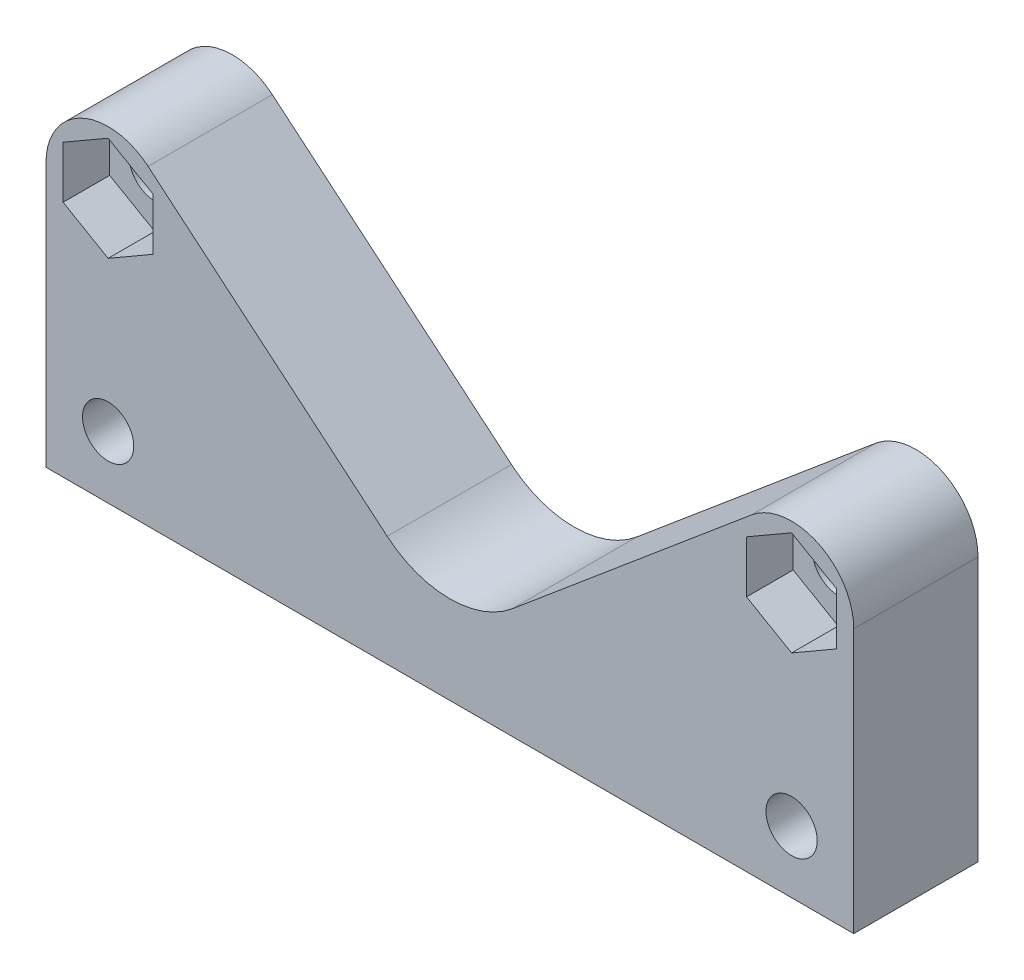
ISO-10303-21;
HEADER;
FILE_DESCRIPTION(('STEP AP214'),'2;1');
FILE_NAME('part.step','',(''),(''),'','','');
FILE_SCHEMA(('AUTOMOTIVE_DESIGN { 1 0 10303 214 1 1 1 1 }'));
ENDSEC;
DATA;
#1=APPLICATION_CONTEXT('core data for automotive mechanical design processes');
#2=APPLICATION_PROTOCOL_DEFINITION('international standard','automotive_design',2000,#1);
#3=PRODUCT_CONTEXT('',#1,'mechanical');
#4=PRODUCT('Part','Part','',(#3));
#5=PRODUCT_RELATED_PRODUCT_CATEGORY('part','',(#4));
#6=PRODUCT_DEFINITION_FORMATION('','',#4);
#7=PRODUCT_DEFINITION_CONTEXT('part definition',#1,'design');
#8=PRODUCT_DEFINITION('design','',#6,#7);
#9=PRODUCT_DEFINITION_SHAPE('','',#8);
#10=(LENGTH_UNIT() NAMED_UNIT(*) SI_UNIT(.MILLI.,.METRE.));
#11=(NAMED_UNIT(*) PLANE_ANGLE_UNIT() SI_UNIT($,.RADIAN.));
#12=(NAMED_UNIT(*) SI_UNIT($,.STERADIAN.) SOLID_ANGLE_UNIT());
#13=UNCERTAINTY_MEASURE_WITH_UNIT(LENGTH_MEASURE(1.E-05),#10,'distance_accuracy_value','');
#14=(GEOMETRIC_REPRESENTATION_CONTEXT(3) GLOBAL_UNCERTAINTY_ASSIGNED_CONTEXT((#13)) GLOBAL_UNIT_ASSIGNED_CONTEXT((#10,
#11,#12)) REPRESENTATION_CONTEXT('',''));
#15=CARTESIAN_POINT('',(0.,0.,0.));
#16=DIRECTION('',(0.,0.,1.));
#17=DIRECTION('',(1.,0.,0.));
#18=AXIS2_PLACEMENT_3D('',#15,#16,#17);
#19=CARTESIAN_POINT('',(48.,17.,8.));
#20=DIRECTION('',(0.,0.,-1.));
#21=DIRECTION('',(-1.,0.,0.));
#22=AXIS2_PLACEMENT_3D('',#19,#20,#21);
#23=CYLINDRICAL_SURFACE('',#22,1.65);
#24=CARTESIAN_POINT('',(48.,17.,0.));
#25=DIRECTION('',(0.,0.,1.));
#26=DIRECTION('',(1.,0.,0.));
#27=AXIS2_PLACEMENT_3D('',#24,#25,#26);
#28=CIRCLE('',#27,1.65);
#29=CARTESIAN_POINT('',(49.65,17.,0.));
#30=VERTEX_POINT('',#29);
#31=EDGE_CURVE('E281',#30,#30,#28,.T.);
#32=ORIENTED_EDGE('',*,*,#31,.F.);
#33=EDGE_LOOP('',(#32));
#34=FACE_BOUND('',#33,.T.);
#35=CARTESIAN_POINT('',(48.,17.,5.));
#36=DIRECTION('',(0.,0.,1.));
#37=DIRECTION('',(1.,0.,0.));
#38=AXIS2_PLACEMENT_3D('',#35,#36,#37);
#39=CIRCLE('',#38,1.65);
#40=CARTESIAN_POINT('',(49.65,17.,5.));
#41=VERTEX_POINT('',#40);
#42=EDGE_CURVE('E35',#41,#41,#39,.T.);
#43=ORIENTED_EDGE('',*,*,#42,.T.);
#44=EDGE_LOOP('',(#43));
#45=FACE_BOUND('',#44,.T.);
#46=ADVANCED_FACE('F31',(#34,#45),#23,.F.);
#47=CARTESIAN_POINT('',(4.,17.,8.));
#48=DIRECTION('',(0.,0.,-1.));
#49=DIRECTION('',(-1.,0.,0.));
#50=AXIS2_PLACEMENT_3D('',#47,#48,#49);
#51=CYLINDRICAL_SURFACE('',#50,1.65);
#52=CARTESIAN_POINT('',(4.,17.,0.));
#53=DIRECTION('',(0.,0.,1.));
#54=DIRECTION('',(1.,0.,0.));
#55=AXIS2_PLACEMENT_3D('',#52,#53,#54);
#56=CIRCLE('',#55,1.65);
#57=CARTESIAN_POINT('',(5.65,17.,0.));
#58=VERTEX_POINT('',#57);
#59=EDGE_CURVE('E286',#58,#58,#56,.T.);
#60=ORIENTED_EDGE('',*,*,#59,.F.);
#61=EDGE_LOOP('',(#60));
#62=FACE_BOUND('',#61,.T.);
#63=CARTESIAN_POINT('',(4.,17.,5.));
#64=DIRECTION('',(0.,0.,1.));
#65=DIRECTION('',(1.,0.,0.));
#66=AXIS2_PLACEMENT_3D('',#63,#64,#65);
#67=CIRCLE('',#66,1.65);
#68=CARTESIAN_POINT('',(5.65,17.,5.));
#69=VERTEX_POINT('',#68);
#70=EDGE_CURVE('E261',#69,#69,#67,.T.);
#71=ORIENTED_EDGE('',*,*,#70,.T.);
#72=EDGE_LOOP('',(#71));
#73=FACE_BOUND('',#72,.T.);
#74=ADVANCED_FACE('F345',(#62,#73),#51,.F.);
#75=CARTESIAN_POINT('',(4.,17.,8.));
#76=DIRECTION('',(0.,0.,1.));
#77=DIRECTION('',(1.,0.,0.));
#78=AXIS2_PLACEMENT_3D('',#75,#76,#77);
#79=PLANE('',#78);
#80=DIRECTION('',(0.866025403784438,-0.5,0.));
#81=VECTOR('',#80,1.);
#82=CARTESIAN_POINT('',(45.1,15.3256842193501,8.));
#83=LINE('',#82,#81);
#84=CARTESIAN_POINT('',(45.1,15.3256842193501,8.));
#85=VERTEX_POINT('',#84);
#86=CARTESIAN_POINT('',(48.,13.6513684387002,8.));
#87=VERTEX_POINT('',#86);
#88=EDGE_CURVE('E48',#85,#87,#83,.T.);
#89=ORIENTED_EDGE('',*,*,#88,.F.);
#90=DIRECTION('',(0.,-1.,0.));
#91=VECTOR('',#90,1.);
#92=CARTESIAN_POINT('',(45.1,18.6743157806499,8.));
#93=LINE('',#92,#91);
#94=CARTESIAN_POINT('',(45.1,18.6743157806499,8.));
#95=VERTEX_POINT('',#94);
#96=EDGE_CURVE('E191',#95,#85,#93,.T.);
#97=ORIENTED_EDGE('',*,*,#96,.F.);
#98=DIRECTION('',(-0.866025403784438,-0.5,0.));
#99=VECTOR('',#98,1.);
#100=CARTESIAN_POINT('',(48.,20.3486315612998,8.));
#101=LINE('',#100,#99);
#102=CARTESIAN_POINT('',(48.,20.3486315612998,8.));
#103=VERTEX_POINT('',#102);
#104=EDGE_CURVE('E194',#103,#95,#101,.T.);
#105=ORIENTED_EDGE('',*,*,#104,.F.);
#106=DIRECTION('',(-0.866025403784438,0.5,0.));
#107=VECTOR('',#106,1.);
#108=CARTESIAN_POINT('',(50.9,18.6743157806499,8.));
#109=LINE('',#108,#107);
#110=CARTESIAN_POINT('',(50.9,18.6743157806499,8.));
#111=VERTEX_POINT('',#110);
#112=EDGE_CURVE('E210',#111,#103,#109,.T.);
#113=ORIENTED_EDGE('',*,*,#112,.F.);
#114=DIRECTION('',(0.,1.,0.));
#115=VECTOR('',#114,1.);
#116=CARTESIAN_POINT('',(50.9,15.3256842193501,8.));
#117=LINE('',#116,#115);
#118=CARTESIAN_POINT('',(50.9,15.3256842193501,8.));
#119=VERTEX_POINT('',#118);
#120=EDGE_CURVE('E207',#119,#111,#117,.T.);
#121=ORIENTED_EDGE('',*,*,#120,.F.);
#122=DIRECTION('',(0.866025403784439,0.5,0.));
#123=VECTOR('',#122,1.);
#124=CARTESIAN_POINT('',(48.,13.6513684387002,8.));
#125=LINE('',#124,#123);
#126=EDGE_CURVE('E205',#87,#119,#125,.T.);
#127=ORIENTED_EDGE('',*,*,#126,.F.);
#128=EDGE_LOOP('',(#89,#97,#105,#113,#121,#127));
#129=FACE_BOUND('',#128,.T.);
#130=DIRECTION('',(0.866025403784439,-0.5,0.));
#131=VECTOR('',#130,1.);
#132=CARTESIAN_POINT('',(1.1,15.3256842193501,8.));
#133=LINE('',#132,#131);
#134=CARTESIAN_POINT('',(1.1,15.3256842193501,8.));
#135=VERTEX_POINT('',#134);
#136=CARTESIAN_POINT('',(4.,13.6513684387002,8.));
#137=VERTEX_POINT('',#136);
#138=EDGE_CURVE('E56',#135,#137,#133,.T.);
#139=ORIENTED_EDGE('',*,*,#138,.F.);
#140=DIRECTION('',(0.,-1.,0.));
#141=VECTOR('',#140,1.);
#142=CARTESIAN_POINT('',(1.1,18.6743157806499,8.));
#143=LINE('',#142,#141);
#144=CARTESIAN_POINT('',(1.1,18.6743157806499,8.));
#145=VERTEX_POINT('',#144);
#146=EDGE_CURVE('E228',#145,#135,#143,.T.);
#147=ORIENTED_EDGE('',*,*,#146,.F.);
#148=DIRECTION('',(-0.866025403784439,-0.5,0.));
#149=VECTOR('',#148,1.);
#150=CARTESIAN_POINT('',(4.,20.3486315612998,8.));
#151=LINE('',#150,#149);
#152=CARTESIAN_POINT('',(4.,20.3486315612998,8.));
#153=VERTEX_POINT('',#152);
#154=EDGE_CURVE('E254',#153,#145,#151,.T.);
#155=ORIENTED_EDGE('',*,*,#154,.F.);
#156=DIRECTION('',(-0.866025403784439,0.5,0.));
#157=VECTOR('',#156,1.);
#158=CARTESIAN_POINT('',(6.9,18.6743157806499,8.));
#159=LINE('',#158,#157);
#160=CARTESIAN_POINT('',(6.9,18.6743157806499,8.));
#161=VERTEX_POINT('',#160);
#162=EDGE_CURVE('E251',#161,#153,#159,.T.);
#163=ORIENTED_EDGE('',*,*,#162,.F.);
#164=DIRECTION('',(0.,1.,0.));
#165=VECTOR('',#164,1.);
#166=CARTESIAN_POINT('',(6.9,15.3256842193501,8.));
#167=LINE('',#166,#165);
#168=CARTESIAN_POINT('',(6.9,15.3256842193501,8.));
#169=VERTEX_POINT('',#168);
#170=EDGE_CURVE('E248',#169,#161,#167,.T.);
#171=ORIENTED_EDGE('',*,*,#170,.F.);
#172=DIRECTION('',(0.866025403784439,0.5,0.));
#173=VECTOR('',#172,1.);
#174=CARTESIAN_POINT('',(4.,13.6513684387002,8.));
#175=LINE('',#174,#173);
#176=EDGE_CURVE('E245',#137,#169,#175,.T.);
#177=ORIENTED_EDGE('',*,*,#176,.F.);
#178=EDGE_LOOP('',(#139,#147,#155,#163,#171,#177));
#179=FACE_BOUND('',#178,.T.);
#180=CARTESIAN_POINT('',(4.,4.,8.));
#181=DIRECTION('',(0.,0.,1.));
#182=DIRECTION('',(1.,0.,0.));
#183=AXIS2_PLACEMENT_3D('',#180,#181,#182);
#184=CIRCLE('',#183,1.65);
#185=CARTESIAN_POINT('',(5.65,4.,8.));
#186=VERTEX_POINT('',#185);
#187=EDGE_CURVE('E278',#186,#186,#184,.T.);
#188=ORIENTED_EDGE('',*,*,#187,.F.);
#189=EDGE_LOOP('',(#188));
#190=FACE_BOUND('',#189,.T.);
#191=DIRECTION('',(0.,-1.,0.));
#192=VECTOR('',#191,1.);
#193=CARTESIAN_POINT('',(0.,0.,8.));
#194=LINE('',#193,#192);
#195=CARTESIAN_POINT('',(0.,17.,8.));
#196=VERTEX_POINT('',#195);
#197=CARTESIAN_POINT('',(0.,0.,8.));
#198=VERTEX_POINT('',#197);
#199=EDGE_CURVE('E290',#196,#198,#194,.T.);
#200=ORIENTED_EDGE('',*,*,#199,.T.);
#201=DIRECTION('',(1.,0.,0.));
#202=VECTOR('',#201,1.);
#203=CARTESIAN_POINT('',(0.,0.,8.));
#204=LINE('',#203,#202);
#205=CARTESIAN_POINT('',(52.,0.,8.));
#206=VERTEX_POINT('',#205);
#207=EDGE_CURVE('E293',#198,#206,#204,.T.);
#208=ORIENTED_EDGE('',*,*,#207,.T.);
#209=DIRECTION('',(0.,1.,0.));
#210=VECTOR('',#209,1.);
#211=CARTESIAN_POINT('',(52.,0.,8.));
#212=LINE('',#211,#210);
#213=CARTESIAN_POINT('',(52.,17.,8.));
#214=VERTEX_POINT('',#213);
#215=EDGE_CURVE('E296',#206,#214,#212,.T.);
#216=ORIENTED_EDGE('',*,*,#215,.T.);
#217=CARTESIAN_POINT('',(48.,17.,8.));
#218=DIRECTION('',(0.,0.,1.));
#219=DIRECTION('',(-1.,0.,0.));
#220=AXIS2_PLACEMENT_3D('',#217,#218,#219);
#221=CIRCLE('',#220,4.);
#222=CARTESIAN_POINT('',(45.427600665244,20.063129390435,8.));
#223=VERTEX_POINT('',#222);
#224=EDGE_CURVE('E298',#214,#223,#221,.T.);
#225=ORIENTED_EDGE('',*,*,#224,.T.);
#226=DIRECTION('',(-0.76578234760875,-0.643099833689009,0.));
#227=VECTOR('',#226,1.);
#228=CARTESIAN_POINT('',(30.0362414874536,7.13755000303716,8.));
#229=LINE('',#228,#227);
#230=CARTESIAN_POINT('',(30.0362414874536,7.13755000303716,8.));
#231=VERTEX_POINT('',#230);
#232=EDGE_CURVE('E300',#223,#231,#229,.T.);
#233=ORIENTED_EDGE('',*,*,#232,.T.);
#234=CARTESIAN_POINT('',(26.,11.9437749775451,8.));
#235=DIRECTION('',(0.,0.,-1.));
#236=DIRECTION('',(1.,0.,0.));
#237=AXIS2_PLACEMENT_3D('',#234,#235,#236);
#238=CIRCLE('',#237,6.27622847342461);
#239=CARTESIAN_POINT('',(21.9637585125464,7.13755000303716,8.));
#240=VERTEX_POINT('',#239);
#241=EDGE_CURVE('E302',#231,#240,#238,.T.);
#242=ORIENTED_EDGE('',*,*,#241,.T.);
#243=DIRECTION('',(-0.76578234760875,0.643099833689009,0.));
#244=VECTOR('',#243,1.);
#245=CARTESIAN_POINT('',(6.57239933475604,20.063129390435,8.));
#246=LINE('',#245,#244);
#247=CARTESIAN_POINT('',(6.57239933475604,20.063129390435,8.));
#248=VERTEX_POINT('',#247);
#249=EDGE_CURVE('E304',#240,#248,#246,.T.);
#250=ORIENTED_EDGE('',*,*,#249,.T.);
#251=CARTESIAN_POINT('',(4.,17.,8.));
#252=DIRECTION('',(0.,0.,1.));
#253=DIRECTION('',(1.,0.,0.));
#254=AXIS2_PLACEMENT_3D('',#251,#252,#253);
#255=CIRCLE('',#254,4.);
#256=EDGE_CURVE('E306',#248,#196,#255,.T.);
#257=ORIENTED_EDGE('',*,*,#256,.T.);
#258=EDGE_LOOP('',(#200,#208,#216,#225,#233,#242,#250,#257));
#259=FACE_BOUND('',#258,.T.);
#260=CARTESIAN_POINT('',(48.,4.,8.));
#261=DIRECTION('',(0.,0.,1.));
#262=DIRECTION('',(1.,0.,0.));
#263=AXIS2_PLACEMENT_3D('',#260,#261,#262);
#264=CIRCLE('',#263,1.65);
#265=CARTESIAN_POINT('',(49.65,4.,8.));
#266=VERTEX_POINT('',#265);
#267=EDGE_CURVE('E271',#266,#266,#264,.T.);
#268=ORIENTED_EDGE('',*,*,#267,.F.);
#269=EDGE_LOOP('',(#268));
#270=FACE_BOUND('',#269,.T.);
#271=ADVANCED_FACE('F374',(#129,#179,#190,#259,#270),#79,.T.);
#272=CARTESIAN_POINT('',(4.,17.,0.));
#273=DIRECTION('',(0.,0.,1.));
#274=DIRECTION('',(1.,0.,0.));
#275=AXIS2_PLACEMENT_3D('',#272,#273,#274);
#276=PLANE('',#275);
#277=CARTESIAN_POINT('',(4.,4.,0.));
#278=DIRECTION('',(0.,0.,1.));
#279=DIRECTION('',(1.,0.,0.));
#280=AXIS2_PLACEMENT_3D('',#277,#278,#279);
#281=CIRCLE('',#280,1.65);
#282=CARTESIAN_POINT('',(5.65,4.,0.));
#283=VERTEX_POINT('',#282);
#284=EDGE_CURVE('E274',#283,#283,#281,.T.);
#285=ORIENTED_EDGE('',*,*,#284,.T.);
#286=EDGE_LOOP('',(#285));
#287=FACE_BOUND('',#286,.T.);
#288=ORIENTED_EDGE('',*,*,#59,.T.);
#289=EDGE_LOOP('',(#288));
#290=FACE_BOUND('',#289,.T.);
#291=DIRECTION('',(0.,-1.,0.));
#292=VECTOR('',#291,1.);
#293=CARTESIAN_POINT('',(0.,0.,0.));
#294=LINE('',#293,#292);
#295=CARTESIAN_POINT('',(0.,17.,0.));
#296=VERTEX_POINT('',#295);
#297=CARTESIAN_POINT('',(0.,0.,0.));
#298=VERTEX_POINT('',#297);
#299=EDGE_CURVE('E289',#296,#298,#294,.T.);
#300=ORIENTED_EDGE('',*,*,#299,.F.);
#301=CARTESIAN_POINT('',(4.,17.,0.));
#302=DIRECTION('',(0.,0.,1.));
#303=DIRECTION('',(1.,0.,0.));
#304=AXIS2_PLACEMENT_3D('',#301,#302,#303);
#305=CIRCLE('',#304,4.);
#306=CARTESIAN_POINT('',(6.57239933475604,20.063129390435,0.));
#307=VERTEX_POINT('',#306);
#308=EDGE_CURVE('E294',#307,#296,#305,.T.);
#309=ORIENTED_EDGE('',*,*,#308,.F.);
#310=DIRECTION('',(-0.76578234760875,0.643099833689009,0.));
#311=VECTOR('',#310,1.);
#312=CARTESIAN_POINT('',(6.57239933475604,20.063129390435,0.));
#313=LINE('',#312,#311);
#314=CARTESIAN_POINT('',(21.9637585125464,7.13755000303716,0.));
#315=VERTEX_POINT('',#314);
#316=EDGE_CURVE('E321',#315,#307,#313,.T.);
#317=ORIENTED_EDGE('',*,*,#316,.F.);
#318=CARTESIAN_POINT('',(26.,11.9437749775451,0.));
#319=DIRECTION('',(0.,0.,-1.));
#320=DIRECTION('',(1.,0.,0.));
#321=AXIS2_PLACEMENT_3D('',#318,#319,#320);
#322=CIRCLE('',#321,6.27622847342461);
#323=CARTESIAN_POINT('',(30.0362414874536,7.13755000303716,0.));
#324=VERTEX_POINT('',#323);
#325=EDGE_CURVE('E319',#324,#315,#322,.T.);
#326=ORIENTED_EDGE('',*,*,#325,.F.);
#327=DIRECTION('',(-0.76578234760875,-0.643099833689009,0.));
#328=VECTOR('',#327,1.);
#329=CARTESIAN_POINT('',(30.0362414874536,7.13755000303716,0.));
#330=LINE('',#329,#328);
#331=CARTESIAN_POINT('',(45.427600665244,20.063129390435,0.));
#332=VERTEX_POINT('',#331);
#333=EDGE_CURVE('E317',#332,#324,#330,.T.);
#334=ORIENTED_EDGE('',*,*,#333,.F.);
#335=CARTESIAN_POINT('',(48.,17.,0.));
#336=DIRECTION('',(0.,0.,1.));
#337=DIRECTION('',(-1.,0.,0.));
#338=AXIS2_PLACEMENT_3D('',#335,#336,#337);
#339=CIRCLE('',#338,4.);
#340=CARTESIAN_POINT('',(52.,17.,0.));
#341=VERTEX_POINT('',#340);
#342=EDGE_CURVE('E315',#341,#332,#339,.T.);
#343=ORIENTED_EDGE('',*,*,#342,.F.);
#344=DIRECTION('',(0.,1.,0.));
#345=VECTOR('',#344,1.);
#346=CARTESIAN_POINT('',(52.,0.,0.));
#347=LINE('',#346,#345);
#348=CARTESIAN_POINT('',(52.,0.,0.));
#349=VERTEX_POINT('',#348);
#350=EDGE_CURVE('E313',#349,#341,#347,.T.);
#351=ORIENTED_EDGE('',*,*,#350,.F.);
#352=DIRECTION('',(1.,0.,0.));
#353=VECTOR('',#352,1.);
#354=CARTESIAN_POINT('',(0.,0.,0.));
#355=LINE('',#354,#353);
#356=EDGE_CURVE('E311',#298,#349,#355,.T.);
#357=ORIENTED_EDGE('',*,*,#356,.F.);
#358=EDGE_LOOP('',(#300,#309,#317,#326,#334,#343,#351,#357));
#359=FACE_BOUND('',#358,.T.);
#360=ORIENTED_EDGE('',*,*,#31,.T.);
#361=EDGE_LOOP('',(#360));
#362=FACE_BOUND('',#361,.T.);
#363=CARTESIAN_POINT('',(48.,4.,0.));
#364=DIRECTION('',(0.,0.,1.));
#365=DIRECTION('',(1.,0.,0.));
#366=AXIS2_PLACEMENT_3D('',#363,#364,#365);
#367=CIRCLE('',#366,1.65);
#368=CARTESIAN_POINT('',(49.65,4.,0.));
#369=VERTEX_POINT('',#368);
#370=EDGE_CURVE('E275',#369,#369,#367,.T.);
#371=ORIENTED_EDGE('',*,*,#370,.T.);
#372=EDGE_LOOP('',(#371));
#373=FACE_BOUND('',#372,.T.);
#374=ADVANCED_FACE('F377',(#287,#290,#359,#362,#373),#276,.F.);
#375=CARTESIAN_POINT('',(0.,0.,8.));
#376=DIRECTION('',(1.,0.,0.));
#377=DIRECTION('',(0.,0.,-1.));
#378=AXIS2_PLACEMENT_3D('',#375,#376,#377);
#379=PLANE('',#378);
#380=ORIENTED_EDGE('',*,*,#299,.T.);
#381=DIRECTION('',(0.,0.,-1.));
#382=VECTOR('',#381,1.);
#383=CARTESIAN_POINT('',(0.,0.,8.));
#384=LINE('',#383,#382);
#385=EDGE_CURVE('E11',#198,#298,#384,.T.);
#386=ORIENTED_EDGE('',*,*,#385,.F.);
#387=ORIENTED_EDGE('',*,*,#199,.F.);
#388=DIRECTION('',(0.,0.,-1.));
#389=VECTOR('',#388,1.);
#390=CARTESIAN_POINT('',(0.,17.,8.));
#391=LINE('',#390,#389);
#392=EDGE_CURVE('E308',#196,#296,#391,.T.);
#393=ORIENTED_EDGE('',*,*,#392,.T.);
#394=EDGE_LOOP('',(#380,#386,#387,#393));
#395=FACE_BOUND('',#394,.T.);
#396=ADVANCED_FACE('F33',(#395),#379,.F.);
#397=CARTESIAN_POINT('',(0.,0.,8.));
#398=DIRECTION('',(0.,1.,0.));
#399=DIRECTION('',(0.,0.,1.));
#400=AXIS2_PLACEMENT_3D('',#397,#398,#399);
#401=PLANE('',#400);
#402=ORIENTED_EDGE('',*,*,#356,.T.);
#403=DIRECTION('',(0.,0.,-1.));
#404=VECTOR('',#403,1.);
#405=CARTESIAN_POINT('',(52.,0.,8.));
#406=LINE('',#405,#404);
#407=EDGE_CURVE('E40',#206,#349,#406,.T.);
#408=ORIENTED_EDGE('',*,*,#407,.F.);
#409=ORIENTED_EDGE('',*,*,#207,.F.);
#410=ORIENTED_EDGE('',*,*,#385,.T.);
#411=EDGE_LOOP('',(#402,#408,#409,#410));
#412=FACE_BOUND('',#411,.T.);
#413=ADVANCED_FACE('F400',(#412),#401,.F.);
#414=CARTESIAN_POINT('',(52.,0.,8.));
#415=DIRECTION('',(-1.,0.,0.));
#416=DIRECTION('',(0.,-1.,0.));
#417=AXIS2_PLACEMENT_3D('',#414,#415,#416);
#418=PLANE('',#417);
#419=ORIENTED_EDGE('',*,*,#350,.T.);
#420=DIRECTION('',(0.,0.,-1.));
#421=VECTOR('',#420,1.);
#422=CARTESIAN_POINT('',(52.,17.,8.));
#423=LINE('',#422,#421);
#424=EDGE_CURVE('E338',#214,#341,#423,.T.);
#425=ORIENTED_EDGE('',*,*,#424,.F.);
#426=ORIENTED_EDGE('',*,*,#215,.F.);
#427=ORIENTED_EDGE('',*,*,#407,.T.);
#428=EDGE_LOOP('',(#419,#425,#426,#427));
#429=FACE_BOUND('',#428,.T.);
#430=ADVANCED_FACE('F555',(#429),#418,.F.);
#431=CARTESIAN_POINT('',(48.,17.,8.));
#432=DIRECTION('',(0.,0.,-1.));
#433=DIRECTION('',(-1.,0.,0.));
#434=AXIS2_PLACEMENT_3D('',#431,#432,#433);
#435=CYLINDRICAL_SURFACE('',#434,4.);
#436=ORIENTED_EDGE('',*,*,#342,.T.);
#437=DIRECTION('',(0.,0.,-1.));
#438=VECTOR('',#437,1.);
#439=CARTESIAN_POINT('',(45.427600665244,20.063129390435,8.));
#440=LINE('',#439,#438);
#441=EDGE_CURVE('E335',#223,#332,#440,.T.);
#442=ORIENTED_EDGE('',*,*,#441,.F.);
#443=ORIENTED_EDGE('',*,*,#224,.F.);
#444=ORIENTED_EDGE('',*,*,#424,.T.);
#445=EDGE_LOOP('',(#436,#442,#443,#444));
#446=FACE_BOUND('',#445,.T.);
#447=ADVANCED_FACE('F547',(#446),#435,.T.);
#448=CARTESIAN_POINT('',(30.0362414874536,7.13755000303716,8.));
#449=DIRECTION('',(0.643099833689009,-0.76578234760875,0.));
#450=DIRECTION('',(0.76578234760875,0.643099833689009,0.));
#451=AXIS2_PLACEMENT_3D('',#448,#449,#450);
#452=PLANE('',#451);
#453=ORIENTED_EDGE('',*,*,#333,.T.);
#454=DIRECTION('',(0.,0.,-1.));
#455=VECTOR('',#454,1.);
#456=CARTESIAN_POINT('',(30.0362414874536,7.13755000303716,8.));
#457=LINE('',#456,#455);
#458=EDGE_CURVE('E332',#231,#324,#457,.T.);
#459=ORIENTED_EDGE('',*,*,#458,.F.);
#460=ORIENTED_EDGE('',*,*,#232,.F.);
#461=ORIENTED_EDGE('',*,*,#441,.T.);
#462=EDGE_LOOP('',(#453,#459,#460,#461));
#463=FACE_BOUND('',#462,.T.);
#464=ADVANCED_FACE('F539',(#463),#452,.F.);
#465=CARTESIAN_POINT('',(26.,11.9437749775451,8.));
#466=DIRECTION('',(0.,0.,-1.));
#467=DIRECTION('',(-1.,0.,0.));
#468=AXIS2_PLACEMENT_3D('',#465,#466,#467);
#469=CYLINDRICAL_SURFACE('',#468,6.27622847342461);
#470=ORIENTED_EDGE('',*,*,#325,.T.);
#471=DIRECTION('',(0.,0.,-1.));
#472=VECTOR('',#471,1.);
#473=CARTESIAN_POINT('',(21.9637585125464,7.13755000303716,8.));
#474=LINE('',#473,#472);
#475=EDGE_CURVE('E329',#240,#315,#474,.T.);
#476=ORIENTED_EDGE('',*,*,#475,.F.);
#477=ORIENTED_EDGE('',*,*,#241,.F.);
#478=ORIENTED_EDGE('',*,*,#458,.T.);
#479=EDGE_LOOP('',(#470,#476,#477,#478));
#480=FACE_BOUND('',#479,.T.);
#481=ADVANCED_FACE('F531',(#480),#469,.F.);
#482=CARTESIAN_POINT('',(6.57239933475604,20.063129390435,8.));
#483=DIRECTION('',(-0.643099833689009,-0.76578234760875,0.));
#484=DIRECTION('',(0.76578234760875,-0.643099833689009,0.));
#485=AXIS2_PLACEMENT_3D('',#482,#483,#484);
#486=PLANE('',#485);
#487=ORIENTED_EDGE('',*,*,#316,.T.);
#488=DIRECTION('',(0.,0.,-1.));
#489=VECTOR('',#488,1.);
#490=CARTESIAN_POINT('',(6.57239933475604,20.063129390435,8.));
#491=LINE('',#490,#489);
#492=EDGE_CURVE('E326',#248,#307,#491,.T.);
#493=ORIENTED_EDGE('',*,*,#492,.F.);
#494=ORIENTED_EDGE('',*,*,#249,.F.);
#495=ORIENTED_EDGE('',*,*,#475,.T.);
#496=EDGE_LOOP('',(#487,#493,#494,#495));
#497=FACE_BOUND('',#496,.T.);
#498=ADVANCED_FACE('F524',(#497),#486,.F.);
#499=CARTESIAN_POINT('',(4.,17.,8.));
#500=DIRECTION('',(0.,0.,-1.));
#501=DIRECTION('',(-1.,0.,0.));
#502=AXIS2_PLACEMENT_3D('',#499,#500,#501);
#503=CYLINDRICAL_SURFACE('',#502,4.);
#504=ORIENTED_EDGE('',*,*,#308,.T.);
#505=ORIENTED_EDGE('',*,*,#392,.F.);
#506=ORIENTED_EDGE('',*,*,#256,.F.);
#507=ORIENTED_EDGE('',*,*,#492,.T.);
#508=EDGE_LOOP('',(#504,#505,#506,#507));
#509=FACE_BOUND('',#508,.T.);
#510=ADVANCED_FACE('F416',(#509),#503,.T.);
#511=CARTESIAN_POINT('',(4.,4.,8.));
#512=DIRECTION('',(0.,0.,-1.));
#513=DIRECTION('',(-1.,0.,0.));
#514=AXIS2_PLACEMENT_3D('',#511,#512,#513);
#515=CYLINDRICAL_SURFACE('',#514,1.65);
#516=ORIENTED_EDGE('',*,*,#187,.T.);
#517=EDGE_LOOP('',(#516));
#518=FACE_BOUND('',#517,.T.);
#519=ORIENTED_EDGE('',*,*,#284,.F.);
#520=EDGE_LOOP('',(#519));
#521=FACE_BOUND('',#520,.T.);
#522=ADVANCED_FACE('F390',(#518,#521),#515,.F.);
#523=CARTESIAN_POINT('',(48.,4.,8.));
#524=DIRECTION('',(0.,0.,-1.));
#525=DIRECTION('',(-1.,0.,0.));
#526=AXIS2_PLACEMENT_3D('',#523,#524,#525);
#527=CYLINDRICAL_SURFACE('',#526,1.65);
#528=ORIENTED_EDGE('',*,*,#267,.T.);
#529=EDGE_LOOP('',(#528));
#530=FACE_BOUND('',#529,.T.);
#531=ORIENTED_EDGE('',*,*,#370,.F.);
#532=EDGE_LOOP('',(#531));
#533=FACE_BOUND('',#532,.T.);
#534=ADVANCED_FACE('F387',(#530,#533),#527,.F.);
#535=CARTESIAN_POINT('',(1.1,15.3256842193501,5.));
#536=DIRECTION('',(-0.5,-0.866025403784439,0.));
#537=DIRECTION('',(0.866025403784439,-0.5,0.));
#538=AXIS2_PLACEMENT_3D('',#535,#536,#537);
#539=PLANE('',#538);
#540=ORIENTED_EDGE('',*,*,#138,.T.);
#541=DIRECTION('',(0.,0.,1.));
#542=VECTOR('',#541,1.);
#543=CARTESIAN_POINT('',(4.,13.6513684387002,5.));
#544=LINE('',#543,#542);
#545=CARTESIAN_POINT('',(4.,13.6513684387002,5.));
#546=VERTEX_POINT('',#545);
#547=EDGE_CURVE('E243',#546,#137,#544,.T.);
#548=ORIENTED_EDGE('',*,*,#547,.F.);
#549=DIRECTION('',(0.866025403784439,-0.5,0.));
#550=VECTOR('',#549,1.);
#551=CARTESIAN_POINT('',(1.1,15.3256842193501,5.));
#552=LINE('',#551,#550);
#553=CARTESIAN_POINT('',(1.1,15.3256842193501,5.));
#554=VERTEX_POINT('',#553);
#555=EDGE_CURVE('E224',#554,#546,#552,.T.);
#556=ORIENTED_EDGE('',*,*,#555,.F.);
#557=DIRECTION('',(0.,0.,1.));
#558=VECTOR('',#557,1.);
#559=CARTESIAN_POINT('',(1.1,15.3256842193501,5.));
#560=LINE('',#559,#558);
#561=EDGE_CURVE('E259',#554,#135,#560,.T.);
#562=ORIENTED_EDGE('',*,*,#561,.T.);
#563=EDGE_LOOP('',(#540,#548,#556,#562));
#564=FACE_BOUND('',#563,.T.);
#565=ADVANCED_FACE('F355',(#564),#539,.F.);
#566=CARTESIAN_POINT('',(1.1,18.6743157806499,5.));
#567=DIRECTION('',(-1.,0.,0.));
#568=DIRECTION('',(0.,-1.,0.));
#569=AXIS2_PLACEMENT_3D('',#566,#567,#568);
#570=PLANE('',#569);
#571=ORIENTED_EDGE('',*,*,#146,.T.);
#572=ORIENTED_EDGE('',*,*,#561,.F.);
#573=DIRECTION('',(0.,-1.,0.));
#574=VECTOR('',#573,1.);
#575=CARTESIAN_POINT('',(1.1,18.6743157806499,5.));
#576=LINE('',#575,#574);
#577=CARTESIAN_POINT('',(1.1,18.6743157806499,5.));
#578=VERTEX_POINT('',#577);
#579=EDGE_CURVE('E240',#578,#554,#576,.T.);
#580=ORIENTED_EDGE('',*,*,#579,.F.);
#581=DIRECTION('',(0.,0.,1.));
#582=VECTOR('',#581,1.);
#583=CARTESIAN_POINT('',(1.1,18.6743157806499,5.));
#584=LINE('',#583,#582);
#585=EDGE_CURVE('E262',#578,#145,#584,.T.);
#586=ORIENTED_EDGE('',*,*,#585,.T.);
#587=EDGE_LOOP('',(#571,#572,#580,#586));
#588=FACE_BOUND('',#587,.T.);
#589=ADVANCED_FACE('F372',(#588),#570,.F.);
#590=CARTESIAN_POINT('',(4.,20.3486315612998,5.));
#591=DIRECTION('',(-0.5,0.866025403784439,0.));
#592=DIRECTION('',(-0.866025403784439,-0.5,0.));
#593=AXIS2_PLACEMENT_3D('',#590,#591,#592);
#594=PLANE('',#593);
#595=ORIENTED_EDGE('',*,*,#154,.T.);
#596=ORIENTED_EDGE('',*,*,#585,.F.);
#597=DIRECTION('',(-0.866025403784439,-0.5,0.));
#598=VECTOR('',#597,1.);
#599=CARTESIAN_POINT('',(4.,20.3486315612998,5.));
#600=LINE('',#599,#598);
#601=CARTESIAN_POINT('',(4.,20.3486315612998,5.));
#602=VERTEX_POINT('',#601);
#603=EDGE_CURVE('E237',#602,#578,#600,.T.);
#604=ORIENTED_EDGE('',*,*,#603,.F.);
#605=DIRECTION('',(0.,0.,1.));
#606=VECTOR('',#605,1.);
#607=CARTESIAN_POINT('',(4.,20.3486315612998,5.));
#608=LINE('',#607,#606);
#609=EDGE_CURVE('E264',#602,#153,#608,.T.);
#610=ORIENTED_EDGE('',*,*,#609,.T.);
#611=EDGE_LOOP('',(#595,#596,#604,#610));
#612=FACE_BOUND('',#611,.T.);
#613=ADVANCED_FACE('F369',(#612),#594,.F.);
#614=CARTESIAN_POINT('',(6.9,18.6743157806499,5.));
#615=DIRECTION('',(0.5,0.866025403784439,0.));
#616=DIRECTION('',(-0.866025403784439,0.5,0.));
#617=AXIS2_PLACEMENT_3D('',#614,#615,#616);
#618=PLANE('',#617);
#619=ORIENTED_EDGE('',*,*,#162,.T.);
#620=ORIENTED_EDGE('',*,*,#609,.F.);
#621=DIRECTION('',(-0.866025403784439,0.5,0.));
#622=VECTOR('',#621,1.);
#623=CARTESIAN_POINT('',(6.9,18.6743157806499,5.));
#624=LINE('',#623,#622);
#625=CARTESIAN_POINT('',(6.9,18.6743157806499,5.));
#626=VERTEX_POINT('',#625);
#627=EDGE_CURVE('E234',#626,#602,#624,.T.);
#628=ORIENTED_EDGE('',*,*,#627,.F.);
#629=DIRECTION('',(0.,0.,1.));
#630=VECTOR('',#629,1.);
#631=CARTESIAN_POINT('',(6.9,18.6743157806499,5.));
#632=LINE('',#631,#630);
#633=EDGE_CURVE('E266',#626,#161,#632,.T.);
#634=ORIENTED_EDGE('',*,*,#633,.T.);
#635=EDGE_LOOP('',(#619,#620,#628,#634));
#636=FACE_BOUND('',#635,.T.);
#637=ADVANCED_FACE('F365',(#636),#618,.F.);
#638=CARTESIAN_POINT('',(6.9,15.3256842193501,5.));
#639=DIRECTION('',(1.,0.,0.));
#640=DIRECTION('',(0.,0.,-1.));
#641=AXIS2_PLACEMENT_3D('',#638,#639,#640);
#642=PLANE('',#641);
#643=ORIENTED_EDGE('',*,*,#170,.T.);
#644=ORIENTED_EDGE('',*,*,#633,.F.);
#645=DIRECTION('',(0.,1.,0.));
#646=VECTOR('',#645,1.);
#647=CARTESIAN_POINT('',(6.9,15.3256842193501,5.));
#648=LINE('',#647,#646);
#649=CARTESIAN_POINT('',(6.9,15.3256842193501,5.));
#650=VERTEX_POINT('',#649);
#651=EDGE_CURVE('E231',#650,#626,#648,.T.);
#652=ORIENTED_EDGE('',*,*,#651,.F.);
#653=DIRECTION('',(0.,0.,1.));
#654=VECTOR('',#653,1.);
#655=CARTESIAN_POINT('',(6.9,15.3256842193501,5.));
#656=LINE('',#655,#654);
#657=EDGE_CURVE('E268',#650,#169,#656,.T.);
#658=ORIENTED_EDGE('',*,*,#657,.T.);
#659=EDGE_LOOP('',(#643,#644,#652,#658));
#660=FACE_BOUND('',#659,.T.);
#661=ADVANCED_FACE('F361',(#660),#642,.F.);
#662=CARTESIAN_POINT('',(4.,13.6513684387002,5.));
#663=DIRECTION('',(0.5,-0.866025403784438,0.));
#664=DIRECTION('',(0.866025403784439,0.5,0.));
#665=AXIS2_PLACEMENT_3D('',#662,#663,#664);
#666=PLANE('',#665);
#667=ORIENTED_EDGE('',*,*,#176,.T.);
#668=ORIENTED_EDGE('',*,*,#657,.F.);
#669=DIRECTION('',(0.866025403784439,0.5,0.));
#670=VECTOR('',#669,1.);
#671=CARTESIAN_POINT('',(4.,13.6513684387002,5.));
#672=LINE('',#671,#670);
#673=EDGE_CURVE('E227',#546,#650,#672,.T.);
#674=ORIENTED_EDGE('',*,*,#673,.F.);
#675=ORIENTED_EDGE('',*,*,#547,.T.);
#676=EDGE_LOOP('',(#667,#668,#674,#675));
#677=FACE_BOUND('',#676,.T.);
#678=ADVANCED_FACE('F350',(#677),#666,.F.);
#679=CARTESIAN_POINT('',(4.,13.6513684387002,5.));
#680=DIRECTION('',(0.,0.,1.));
#681=DIRECTION('',(1.,0.,0.));
#682=AXIS2_PLACEMENT_3D('',#679,#680,#681);
#683=PLANE('',#682);
#684=ORIENTED_EDGE('',*,*,#70,.F.);
#685=EDGE_LOOP('',(#684));
#686=FACE_BOUND('',#685,.T.);
#687=ORIENTED_EDGE('',*,*,#555,.T.);
#688=ORIENTED_EDGE('',*,*,#673,.T.);
#689=ORIENTED_EDGE('',*,*,#651,.T.);
#690=ORIENTED_EDGE('',*,*,#627,.T.);
#691=ORIENTED_EDGE('',*,*,#603,.T.);
#692=ORIENTED_EDGE('',*,*,#579,.T.);
#693=EDGE_LOOP('',(#687,#688,#689,#690,#691,#692));
#694=FACE_BOUND('',#693,.T.);
#695=ADVANCED_FACE('F347',(#686,#694),#683,.T.);
#696=CARTESIAN_POINT('',(45.1,15.3256842193501,5.));
#697=DIRECTION('',(-0.5,-0.866025403784438,0.));
#698=DIRECTION('',(0.866025403784439,-0.5,0.));
#699=AXIS2_PLACEMENT_3D('',#696,#697,#698);
#700=PLANE('',#699);
#701=ORIENTED_EDGE('',*,*,#88,.T.);
#702=DIRECTION('',(0.,0.,1.));
#703=VECTOR('',#702,1.);
#704=CARTESIAN_POINT('',(48.,13.6513684387002,5.));
#705=LINE('',#704,#703);
#706=CARTESIAN_POINT('',(48.,13.6513684387002,5.));
#707=VERTEX_POINT('',#706);
#708=EDGE_CURVE('E168',#707,#87,#705,.T.);
#709=ORIENTED_EDGE('',*,*,#708,.F.);
#710=DIRECTION('',(0.866025403784438,-0.5,0.));
#711=VECTOR('',#710,1.);
#712=CARTESIAN_POINT('',(45.1,15.3256842193501,5.));
#713=LINE('',#712,#711);
#714=CARTESIAN_POINT('',(45.1,15.3256842193501,5.));
#715=VERTEX_POINT('',#714);
#716=EDGE_CURVE('E172',#715,#707,#713,.T.);
#717=ORIENTED_EDGE('',*,*,#716,.F.);
#718=DIRECTION('',(0.,0.,1.));
#719=VECTOR('',#718,1.);
#720=CARTESIAN_POINT('',(45.1,15.3256842193501,5.));
#721=LINE('',#720,#719);
#722=EDGE_CURVE('E215',#715,#85,#721,.T.);
#723=ORIENTED_EDGE('',*,*,#722,.T.);
#724=EDGE_LOOP('',(#701,#709,#717,#723));
#725=FACE_BOUND('',#724,.T.);
#726=ADVANCED_FACE('F170',(#725),#700,.F.);
#727=CARTESIAN_POINT('',(45.1,18.6743157806499,5.));
#728=DIRECTION('',(-1.,0.,0.));
#729=DIRECTION('',(0.,0.,1.));
#730=AXIS2_PLACEMENT_3D('',#727,#728,#729);
#731=PLANE('',#730);
#732=ORIENTED_EDGE('',*,*,#96,.T.);
#733=ORIENTED_EDGE('',*,*,#722,.F.);
#734=DIRECTION('',(0.,-1.,0.));
#735=VECTOR('',#734,1.);
#736=CARTESIAN_POINT('',(45.1,18.6743157806499,5.));
#737=LINE('',#736,#735);
#738=CARTESIAN_POINT('',(45.1,18.6743157806499,5.));
#739=VERTEX_POINT('',#738);
#740=EDGE_CURVE('E178',#739,#715,#737,.T.);
#741=ORIENTED_EDGE('',*,*,#740,.F.);
#742=DIRECTION('',(0.,0.,1.));
#743=VECTOR('',#742,1.);
#744=CARTESIAN_POINT('',(45.1,18.6743157806499,5.));
#745=LINE('',#744,#743);
#746=EDGE_CURVE('E217',#739,#95,#745,.T.);
#747=ORIENTED_EDGE('',*,*,#746,.T.);
#748=EDGE_LOOP('',(#732,#733,#741,#747));
#749=FACE_BOUND('',#748,.T.);
#750=ADVANCED_FACE('F433',(#749),#731,.F.);
#751=CARTESIAN_POINT('',(48.,20.3486315612998,5.));
#752=DIRECTION('',(-0.5,0.866025403784438,0.));
#753=DIRECTION('',(-0.866025403784439,-0.5,0.));
#754=AXIS2_PLACEMENT_3D('',#751,#752,#753);
#755=PLANE('',#754);
#756=ORIENTED_EDGE('',*,*,#104,.T.);
#757=ORIENTED_EDGE('',*,*,#746,.F.);
#758=DIRECTION('',(-0.866025403784438,-0.5,0.));
#759=VECTOR('',#758,1.);
#760=CARTESIAN_POINT('',(48.,20.3486315612998,5.));
#761=LINE('',#760,#759);
#762=CARTESIAN_POINT('',(48.,20.3486315612998,5.));
#763=VERTEX_POINT('',#762);
#764=EDGE_CURVE('E201',#763,#739,#761,.T.);
#765=ORIENTED_EDGE('',*,*,#764,.F.);
#766=DIRECTION('',(0.,0.,1.));
#767=VECTOR('',#766,1.);
#768=CARTESIAN_POINT('',(48.,20.3486315612998,5.));
#769=LINE('',#768,#767);
#770=EDGE_CURVE('E219',#763,#103,#769,.T.);
#771=ORIENTED_EDGE('',*,*,#770,.T.);
#772=EDGE_LOOP('',(#756,#757,#765,#771));
#773=FACE_BOUND('',#772,.T.);
#774=ADVANCED_FACE('F443',(#773),#755,.F.);
#775=CARTESIAN_POINT('',(50.9,18.6743157806499,5.));
#776=DIRECTION('',(0.5,0.866025403784438,0.));
#777=DIRECTION('',(-0.866025403784439,0.5,0.));
#778=AXIS2_PLACEMENT_3D('',#775,#776,#777);
#779=PLANE('',#778);
#780=ORIENTED_EDGE('',*,*,#112,.T.);
#781=ORIENTED_EDGE('',*,*,#770,.F.);
#782=DIRECTION('',(-0.866025403784438,0.5,0.));
#783=VECTOR('',#782,1.);
#784=CARTESIAN_POINT('',(50.9,18.6743157806499,5.));
#785=LINE('',#784,#783);
#786=CARTESIAN_POINT('',(50.9,18.6743157806499,5.));
#787=VERTEX_POINT('',#786);
#788=EDGE_CURVE('E198',#787,#763,#785,.T.);
#789=ORIENTED_EDGE('',*,*,#788,.F.);
#790=DIRECTION('',(0.,0.,1.));
#791=VECTOR('',#790,1.);
#792=CARTESIAN_POINT('',(50.9,18.6743157806499,5.));
#793=LINE('',#792,#791);
#794=EDGE_CURVE('E221',#787,#111,#793,.T.);
#795=ORIENTED_EDGE('',*,*,#794,.T.);
#796=EDGE_LOOP('',(#780,#781,#789,#795));
#797=FACE_BOUND('',#796,.T.);
#798=ADVANCED_FACE('F439',(#797),#779,.F.);
#799=CARTESIAN_POINT('',(50.9,15.3256842193501,5.));
#800=DIRECTION('',(1.,0.,0.));
#801=DIRECTION('',(0.,0.,-1.));
#802=AXIS2_PLACEMENT_3D('',#799,#800,#801);
#803=PLANE('',#802);
#804=ORIENTED_EDGE('',*,*,#120,.T.);
#805=ORIENTED_EDGE('',*,*,#794,.F.);
#806=DIRECTION('',(0.,1.,0.));
#807=VECTOR('',#806,1.);
#808=CARTESIAN_POINT('',(50.9,15.3256842193501,5.));
#809=LINE('',#808,#807);
#810=CARTESIAN_POINT('',(50.9,15.3256842193501,5.));
#811=VERTEX_POINT('',#810);
#812=EDGE_CURVE('E186',#811,#787,#809,.T.);
#813=ORIENTED_EDGE('',*,*,#812,.F.);
#814=DIRECTION('',(0.,0.,1.));
#815=VECTOR('',#814,1.);
#816=CARTESIAN_POINT('',(50.9,15.3256842193501,5.));
#817=LINE('',#816,#815);
#818=EDGE_CURVE('E177',#811,#119,#817,.T.);
#819=ORIENTED_EDGE('',*,*,#818,.T.);
#820=EDGE_LOOP('',(#804,#805,#813,#819));
#821=FACE_BOUND('',#820,.T.);
#822=ADVANCED_FACE('F436',(#821),#803,.F.);
#823=CARTESIAN_POINT('',(48.,13.6513684387002,5.));
#824=DIRECTION('',(0.5,-0.866025403784439,0.));
#825=DIRECTION('',(0.866025403784439,0.5,0.));
#826=AXIS2_PLACEMENT_3D('',#823,#824,#825);
#827=PLANE('',#826);
#828=ORIENTED_EDGE('',*,*,#126,.T.);
#829=ORIENTED_EDGE('',*,*,#818,.F.);
#830=DIRECTION('',(0.866025403784439,0.5,0.));
#831=VECTOR('',#830,1.);
#832=CARTESIAN_POINT('',(48.,13.6513684387002,5.));
#833=LINE('',#832,#831);
#834=EDGE_CURVE('E181',#707,#811,#833,.T.);
#835=ORIENTED_EDGE('',*,*,#834,.F.);
#836=ORIENTED_EDGE('',*,*,#708,.T.);
#837=EDGE_LOOP('',(#828,#829,#835,#836));
#838=FACE_BOUND('',#837,.T.);
#839=ADVANCED_FACE('F182',(#838),#827,.F.);
#840=CARTESIAN_POINT('',(48.,13.6513684387002,5.));
#841=DIRECTION('',(0.,0.,1.));
#842=DIRECTION('',(1.,0.,0.));
#843=AXIS2_PLACEMENT_3D('',#840,#841,#842);
#844=PLANE('',#843);
#845=ORIENTED_EDGE('',*,*,#42,.F.);
#846=EDGE_LOOP('',(#845));
#847=FACE_BOUND('',#846,.T.);
#848=ORIENTED_EDGE('',*,*,#716,.T.);
#849=ORIENTED_EDGE('',*,*,#834,.T.);
#850=ORIENTED_EDGE('',*,*,#812,.T.);
#851=ORIENTED_EDGE('',*,*,#788,.T.);
#852=ORIENTED_EDGE('',*,*,#764,.T.);
#853=ORIENTED_EDGE('',*,*,#740,.T.);
#854=EDGE_LOOP('',(#848,#849,#850,#851,#852,#853));
#855=FACE_BOUND('',#854,.T.);
#856=ADVANCED_FACE('F188',(#847,#855),#844,.T.);
#857=CLOSED_SHELL('',(#46,#74,#271,#374,#396,#413,#430,#447,#464,#481,#498,#510,#522,#534,#565,
#589,#613,#637,#661,#678,#695,#726,#750,#774,#798,#822,#839,#856));
#858=MANIFOLD_SOLID_BREP('B2',#857);
#859=ADVANCED_BREP_SHAPE_REPRESENTATION('',(#18,#858),#14);
#860=SHAPE_DEFINITION_REPRESENTATION(#9,#859);
ENDSEC;
END-ISO-10303-21;
